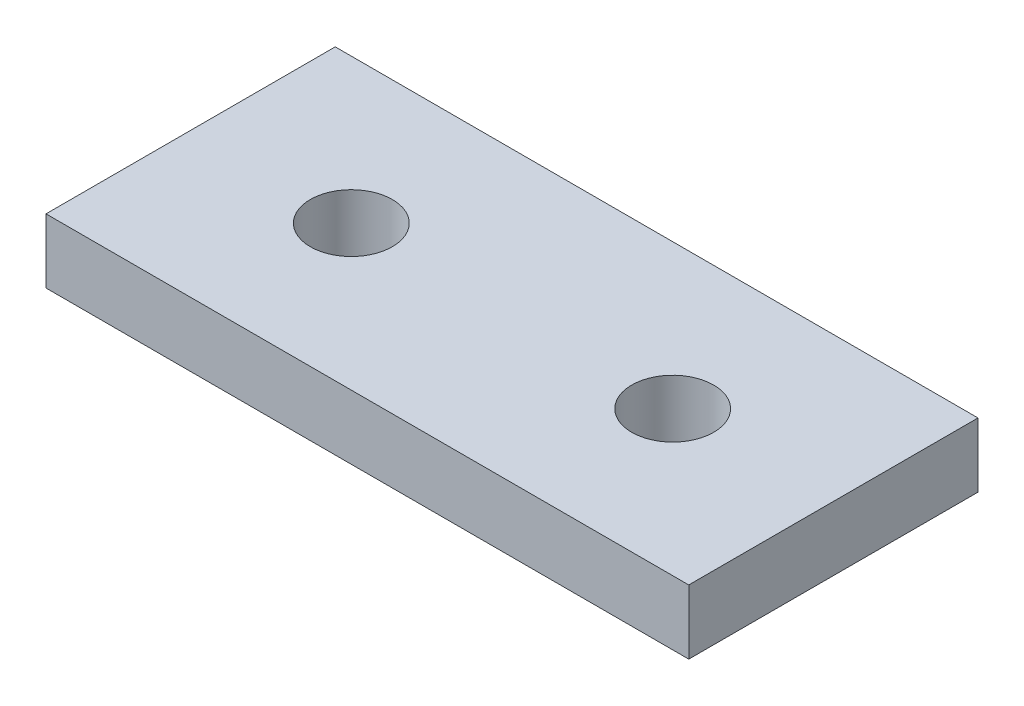
ISO-10303-21;
HEADER;
FILE_DESCRIPTION(('STEP AP214'),'2;1');
FILE_NAME('part.step','',(''),(''),'','','');
FILE_SCHEMA(('AUTOMOTIVE_DESIGN { 1 0 10303 214 1 1 1 1 }'));
ENDSEC;
DATA;
#1=APPLICATION_CONTEXT('core data for automotive mechanical design processes');
#2=APPLICATION_PROTOCOL_DEFINITION('international standard','automotive_design',2000,#1);
#3=PRODUCT_CONTEXT('',#1,'mechanical');
#4=PRODUCT('Part','Part','',(#3));
#5=PRODUCT_RELATED_PRODUCT_CATEGORY('part','',(#4));
#6=PRODUCT_DEFINITION_FORMATION('','',#4);
#7=PRODUCT_DEFINITION_CONTEXT('part definition',#1,'design');
#8=PRODUCT_DEFINITION('design','',#6,#7);
#9=PRODUCT_DEFINITION_SHAPE('','',#8);
#10=(LENGTH_UNIT() NAMED_UNIT(*) SI_UNIT(.MILLI.,.METRE.));
#11=(NAMED_UNIT(*) PLANE_ANGLE_UNIT() SI_UNIT($,.RADIAN.));
#12=(NAMED_UNIT(*) SI_UNIT($,.STERADIAN.) SOLID_ANGLE_UNIT());
#13=UNCERTAINTY_MEASURE_WITH_UNIT(LENGTH_MEASURE(1.E-05),#10,'distance_accuracy_value','');
#14=(GEOMETRIC_REPRESENTATION_CONTEXT(3) GLOBAL_UNCERTAINTY_ASSIGNED_CONTEXT((#13)) GLOBAL_UNIT_ASSIGNED_CONTEXT((#10,
#11,#12)) REPRESENTATION_CONTEXT('',''));
#15=CARTESIAN_POINT('',(0.,0.,0.));
#16=DIRECTION('',(0.,0.,1.));
#17=DIRECTION('',(1.,0.,0.));
#18=AXIS2_PLACEMENT_3D('',#15,#16,#17);
#19=CARTESIAN_POINT('',(0.,4.,0.));
#20=DIRECTION('',(0.,1.,0.));
#21=DIRECTION('',(0.,0.,1.));
#22=AXIS2_PLACEMENT_3D('',#19,#20,#21);
#23=PLANE('',#22);
#24=CARTESIAN_POINT('',(-10.,4.,0.));
#25=DIRECTION('',(0.,1.,0.));
#26=DIRECTION('',(0.,0.,1.));
#27=AXIS2_PLACEMENT_3D('',#24,#25,#26);
#28=CIRCLE('',#27,2.55);
#29=CARTESIAN_POINT('',(-10.,4.,2.55));
#30=VERTEX_POINT('',#29);
#31=EDGE_CURVE('E103',#30,#30,#28,.T.);
#32=ORIENTED_EDGE('',*,*,#31,.F.);
#33=EDGE_LOOP('',(#32));
#34=FACE_BOUND('',#33,.T.);
#35=DIRECTION('',(0.,0.,1.));
#36=VECTOR('',#35,1.);
#37=CARTESIAN_POINT('',(-20.,4.,9.));
#38=LINE('',#37,#36);
#39=CARTESIAN_POINT('',(-20.,4.,-9.));
#40=VERTEX_POINT('',#39);
#41=CARTESIAN_POINT('',(-20.,4.,9.));
#42=VERTEX_POINT('',#41);
#43=EDGE_CURVE('E88',#40,#42,#38,.T.);
#44=ORIENTED_EDGE('',*,*,#43,.T.);
#45=DIRECTION('',(1.,0.,0.));
#46=VECTOR('',#45,1.);
#47=CARTESIAN_POINT('',(20.,4.,8.99999999999999));
#48=LINE('',#47,#46);
#49=CARTESIAN_POINT('',(20.,4.,8.99999999999999));
#50=VERTEX_POINT('',#49);
#51=EDGE_CURVE('E83',#42,#50,#48,.T.);
#52=ORIENTED_EDGE('',*,*,#51,.T.);
#53=DIRECTION('',(0.,0.,-1.));
#54=VECTOR('',#53,1.);
#55=CARTESIAN_POINT('',(20.,4.,8.99999999999999));
#56=LINE('',#55,#54);
#57=CARTESIAN_POINT('',(20.,4.,-9.00000000000001));
#58=VERTEX_POINT('',#57);
#59=EDGE_CURVE('E86',#50,#58,#56,.T.);
#60=ORIENTED_EDGE('',*,*,#59,.T.);
#61=DIRECTION('',(-1.,0.,0.));
#62=VECTOR('',#61,1.);
#63=CARTESIAN_POINT('',(20.,4.,-9.00000000000001));
#64=LINE('',#63,#62);
#65=EDGE_CURVE('E53',#58,#40,#64,.T.);
#66=ORIENTED_EDGE('',*,*,#65,.T.);
#67=EDGE_LOOP('',(#44,#52,#60,#66));
#68=FACE_BOUND('',#67,.T.);
#69=CARTESIAN_POINT('',(9.99999999999999,4.,0.));
#70=DIRECTION('',(0.,1.,0.));
#71=DIRECTION('',(0.,0.,-1.));
#72=AXIS2_PLACEMENT_3D('',#69,#70,#71);
#73=CIRCLE('',#72,2.55);
#74=CARTESIAN_POINT('',(9.99999999999999,4.,-2.55));
#75=VERTEX_POINT('',#74);
#76=EDGE_CURVE('E118',#75,#75,#73,.T.);
#77=ORIENTED_EDGE('',*,*,#76,.F.);
#78=EDGE_LOOP('',(#77));
#79=FACE_BOUND('',#78,.T.);
#80=ADVANCED_FACE('F36',(#34,#68,#79),#23,.T.);
#81=CARTESIAN_POINT('',(0.,0.,0.));
#82=DIRECTION('',(0.,1.,0.));
#83=DIRECTION('',(0.,0.,1.));
#84=AXIS2_PLACEMENT_3D('',#81,#82,#83);
#85=PLANE('',#84);
#86=CARTESIAN_POINT('',(-10.,0.,0.));
#87=DIRECTION('',(0.,1.,0.));
#88=DIRECTION('',(0.,0.,1.));
#89=AXIS2_PLACEMENT_3D('',#86,#87,#88);
#90=CIRCLE('',#89,2.55);
#91=CARTESIAN_POINT('',(-10.,0.,2.55));
#92=VERTEX_POINT('',#91);
#93=EDGE_CURVE('E115',#92,#92,#90,.T.);
#94=ORIENTED_EDGE('',*,*,#93,.T.);
#95=EDGE_LOOP('',(#94));
#96=FACE_BOUND('',#95,.T.);
#97=DIRECTION('',(0.,0.,1.));
#98=VECTOR('',#97,1.);
#99=CARTESIAN_POINT('',(-20.,0.,9.));
#100=LINE('',#99,#98);
#101=CARTESIAN_POINT('',(-20.,0.,-9.));
#102=VERTEX_POINT('',#101);
#103=CARTESIAN_POINT('',(-20.,0.,9.));
#104=VERTEX_POINT('',#103);
#105=EDGE_CURVE('E100',#102,#104,#100,.T.);
#106=ORIENTED_EDGE('',*,*,#105,.F.);
#107=DIRECTION('',(-1.,0.,0.));
#108=VECTOR('',#107,1.);
#109=CARTESIAN_POINT('',(20.,0.,-9.00000000000001));
#110=LINE('',#109,#108);
#111=CARTESIAN_POINT('',(20.,0.,-9.00000000000001));
#112=VERTEX_POINT('',#111);
#113=EDGE_CURVE('E76',#112,#102,#110,.T.);
#114=ORIENTED_EDGE('',*,*,#113,.F.);
#115=DIRECTION('',(0.,0.,-1.));
#116=VECTOR('',#115,1.);
#117=CARTESIAN_POINT('',(20.,0.,8.99999999999999));
#118=LINE('',#117,#116);
#119=CARTESIAN_POINT('',(20.,0.,8.99999999999999));
#120=VERTEX_POINT('',#119);
#121=EDGE_CURVE('E70',#120,#112,#118,.T.);
#122=ORIENTED_EDGE('',*,*,#121,.F.);
#123=DIRECTION('',(1.,0.,0.));
#124=VECTOR('',#123,1.);
#125=CARTESIAN_POINT('',(20.,0.,8.99999999999999));
#126=LINE('',#125,#124);
#127=EDGE_CURVE('E92',#104,#120,#126,.T.);
#128=ORIENTED_EDGE('',*,*,#127,.F.);
#129=EDGE_LOOP('',(#106,#114,#122,#128));
#130=FACE_BOUND('',#129,.T.);
#131=CARTESIAN_POINT('',(9.99999999999999,0.,0.));
#132=DIRECTION('',(0.,1.,0.));
#133=DIRECTION('',(0.,0.,-1.));
#134=AXIS2_PLACEMENT_3D('',#131,#132,#133);
#135=CIRCLE('',#134,2.55);
#136=CARTESIAN_POINT('',(9.99999999999999,0.,-2.55));
#137=VERTEX_POINT('',#136);
#138=EDGE_CURVE('E121',#137,#137,#135,.T.);
#139=ORIENTED_EDGE('',*,*,#138,.T.);
#140=EDGE_LOOP('',(#139));
#141=FACE_BOUND('',#140,.T.);
#142=ADVANCED_FACE('F111',(#96,#130,#141),#85,.F.);
#143=CARTESIAN_POINT('',(-20.,4.,9.));
#144=DIRECTION('',(1.,0.,0.));
#145=DIRECTION('',(0.,0.,-1.));
#146=AXIS2_PLACEMENT_3D('',#143,#144,#145);
#147=PLANE('',#146);
#148=ORIENTED_EDGE('',*,*,#105,.T.);
#149=DIRECTION('',(0.,-1.,0.));
#150=VECTOR('',#149,1.);
#151=CARTESIAN_POINT('',(-20.,4.,9.));
#152=LINE('',#151,#150);
#153=EDGE_CURVE('E11',#42,#104,#152,.T.);
#154=ORIENTED_EDGE('',*,*,#153,.F.);
#155=ORIENTED_EDGE('',*,*,#43,.F.);
#156=DIRECTION('',(0.,-1.,0.));
#157=VECTOR('',#156,1.);
#158=CARTESIAN_POINT('',(-20.,4.,-9.));
#159=LINE('',#158,#157);
#160=EDGE_CURVE('E96',#40,#102,#159,.T.);
#161=ORIENTED_EDGE('',*,*,#160,.T.);
#162=EDGE_LOOP('',(#148,#154,#155,#161));
#163=FACE_BOUND('',#162,.T.);
#164=ADVANCED_FACE('F38',(#163),#147,.F.);
#165=CARTESIAN_POINT('',(20.,4.,8.99999999999999));
#166=DIRECTION('',(0.,0.,-1.));
#167=DIRECTION('',(-1.,0.,0.));
#168=AXIS2_PLACEMENT_3D('',#165,#166,#167);
#169=PLANE('',#168);
#170=ORIENTED_EDGE('',*,*,#127,.T.);
#171=DIRECTION('',(0.,-1.,0.));
#172=VECTOR('',#171,1.);
#173=CARTESIAN_POINT('',(20.,4.,8.99999999999999));
#174=LINE('',#173,#172);
#175=EDGE_CURVE('E45',#50,#120,#174,.T.);
#176=ORIENTED_EDGE('',*,*,#175,.F.);
#177=ORIENTED_EDGE('',*,*,#51,.F.);
#178=ORIENTED_EDGE('',*,*,#153,.T.);
#179=EDGE_LOOP('',(#170,#176,#177,#178));
#180=FACE_BOUND('',#179,.T.);
#181=ADVANCED_FACE('F91',(#180),#169,.F.);
#182=CARTESIAN_POINT('',(20.,4.,8.99999999999999));
#183=DIRECTION('',(-1.,0.,0.));
#184=DIRECTION('',(0.,0.,1.));
#185=AXIS2_PLACEMENT_3D('',#182,#183,#184);
#186=PLANE('',#185);
#187=ORIENTED_EDGE('',*,*,#121,.T.);
#188=DIRECTION('',(0.,-1.,0.));
#189=VECTOR('',#188,1.);
#190=CARTESIAN_POINT('',(20.,4.,-9.00000000000001));
#191=LINE('',#190,#189);
#192=EDGE_CURVE('E93',#58,#112,#191,.T.);
#193=ORIENTED_EDGE('',*,*,#192,.F.);
#194=ORIENTED_EDGE('',*,*,#59,.F.);
#195=ORIENTED_EDGE('',*,*,#175,.T.);
#196=EDGE_LOOP('',(#187,#193,#194,#195));
#197=FACE_BOUND('',#196,.T.);
#198=ADVANCED_FACE('F94',(#197),#186,.F.);
#199=CARTESIAN_POINT('',(20.,4.,-9.00000000000001));
#200=DIRECTION('',(0.,0.,1.));
#201=DIRECTION('',(1.,0.,0.));
#202=AXIS2_PLACEMENT_3D('',#199,#200,#201);
#203=PLANE('',#202);
#204=ORIENTED_EDGE('',*,*,#113,.T.);
#205=ORIENTED_EDGE('',*,*,#160,.F.);
#206=ORIENTED_EDGE('',*,*,#65,.F.);
#207=ORIENTED_EDGE('',*,*,#192,.T.);
#208=EDGE_LOOP('',(#204,#205,#206,#207));
#209=FACE_BOUND('',#208,.T.);
#210=ADVANCED_FACE('F108',(#209),#203,.F.);
#211=CARTESIAN_POINT('',(-10.,4.,0.));
#212=DIRECTION('',(0.,-1.,0.));
#213=DIRECTION('',(0.,0.,-1.));
#214=AXIS2_PLACEMENT_3D('',#211,#212,#213);
#215=CYLINDRICAL_SURFACE('',#214,2.55);
#216=ORIENTED_EDGE('',*,*,#31,.T.);
#217=EDGE_LOOP('',(#216));
#218=FACE_BOUND('',#217,.T.);
#219=ORIENTED_EDGE('',*,*,#93,.F.);
#220=EDGE_LOOP('',(#219));
#221=FACE_BOUND('',#220,.T.);
#222=ADVANCED_FACE('F139',(#218,#221),#215,.F.);
#223=CARTESIAN_POINT('',(9.99999999999999,4.,0.));
#224=DIRECTION('',(0.,-1.,0.));
#225=DIRECTION('',(0.,0.,-1.));
#226=AXIS2_PLACEMENT_3D('',#223,#224,#225);
#227=CYLINDRICAL_SURFACE('',#226,2.55);
#228=ORIENTED_EDGE('',*,*,#76,.T.);
#229=EDGE_LOOP('',(#228));
#230=FACE_BOUND('',#229,.T.);
#231=ORIENTED_EDGE('',*,*,#138,.F.);
#232=EDGE_LOOP('',(#231));
#233=FACE_BOUND('',#232,.T.);
#234=ADVANCED_FACE('F127',(#230,#233),#227,.F.);
#235=CLOSED_SHELL('',(#80,#142,#164,#181,#198,#210,#222,#234));
#236=MANIFOLD_SOLID_BREP('B2',#235);
#237=ADVANCED_BREP_SHAPE_REPRESENTATION('',(#18,#236),#14);
#238=SHAPE_DEFINITION_REPRESENTATION(#9,#237);
ENDSEC;
END-ISO-10303-21;
